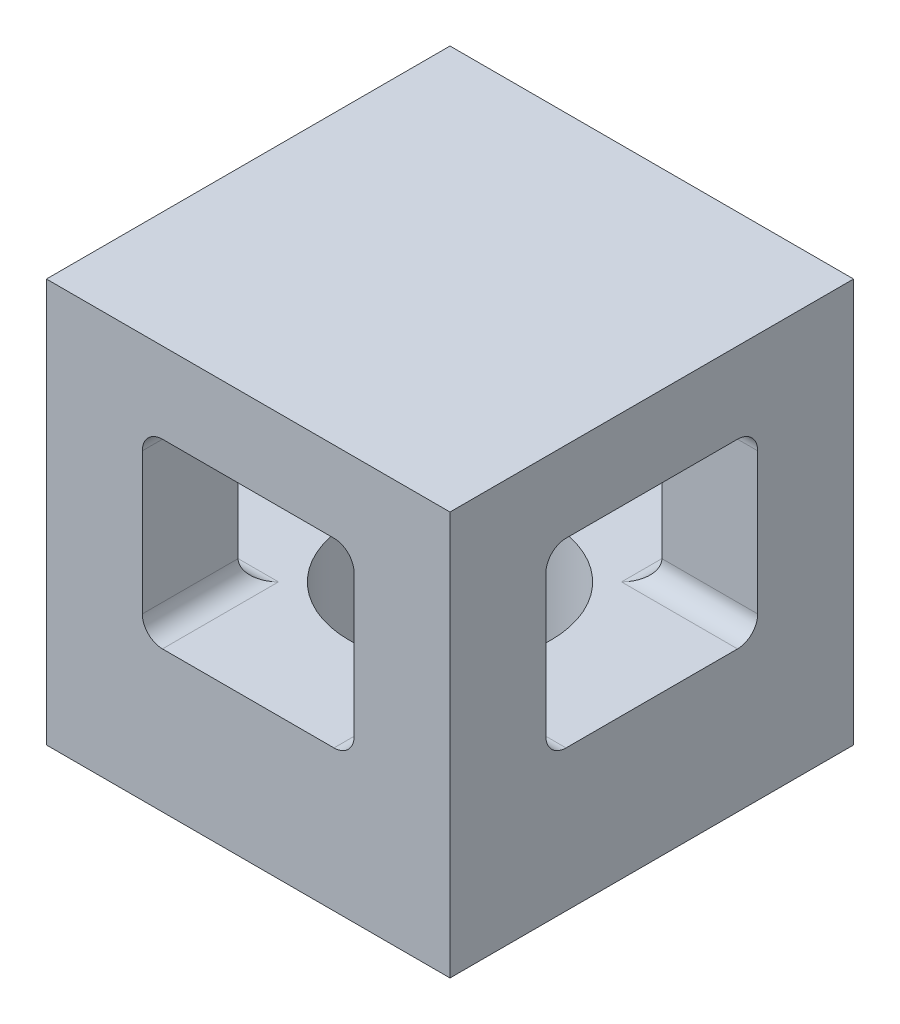
ISO-10303-21;
HEADER;
FILE_DESCRIPTION(('STEP AP214'),'2;1');
FILE_NAME('part.step','',(''),(''),'','','');
FILE_SCHEMA(('AUTOMOTIVE_DESIGN { 1 0 10303 214 1 1 1 1 }'));
ENDSEC;
DATA;
#1=APPLICATION_CONTEXT('core data for automotive mechanical design processes');
#2=APPLICATION_PROTOCOL_DEFINITION('international standard','automotive_design',2000,#1);
#3=PRODUCT_CONTEXT('',#1,'mechanical');
#4=PRODUCT('Part','Part','',(#3));
#5=PRODUCT_RELATED_PRODUCT_CATEGORY('part','',(#4));
#6=PRODUCT_DEFINITION_FORMATION('','',#4);
#7=PRODUCT_DEFINITION_CONTEXT('part definition',#1,'design');
#8=PRODUCT_DEFINITION('design','',#6,#7);
#9=PRODUCT_DEFINITION_SHAPE('','',#8);
#10=(LENGTH_UNIT() NAMED_UNIT(*) SI_UNIT(.MILLI.,.METRE.));
#11=(NAMED_UNIT(*) PLANE_ANGLE_UNIT() SI_UNIT($,.RADIAN.));
#12=(NAMED_UNIT(*) SI_UNIT($,.STERADIAN.) SOLID_ANGLE_UNIT());
#13=UNCERTAINTY_MEASURE_WITH_UNIT(LENGTH_MEASURE(1.E-05),#10,'distance_accuracy_value','');
#14=(GEOMETRIC_REPRESENTATION_CONTEXT(3) GLOBAL_UNCERTAINTY_ASSIGNED_CONTEXT((#13)) GLOBAL_UNIT_ASSIGNED_CONTEXT((#10,
#11,#12)) REPRESENTATION_CONTEXT('',''));
#15=CARTESIAN_POINT('',(0.,0.,0.));
#16=DIRECTION('',(0.,0.,1.));
#17=DIRECTION('',(1.,0.,0.));
#18=AXIS2_PLACEMENT_3D('',#15,#16,#17);
#19=CARTESIAN_POINT('',(0.,4.064,-2.921));
#20=DIRECTION('',(1.,0.,0.));
#21=DIRECTION('',(0.,0.,-1.));
#22=AXIS2_PLACEMENT_3D('',#19,#20,#21);
#23=CYLINDRICAL_SURFACE('',#22,0.508);
#24=DIRECTION('',(1.,0.,0.));
#25=VECTOR('',#24,1.);
#26=CARTESIAN_POINT('',(0.,4.064,-2.413));
#27=LINE('',#26,#25);
#28=CARTESIAN_POINT('',(0.,4.064,-2.413));
#29=VERTEX_POINT('',#28);
#30=CARTESIAN_POINT('',(2.413,4.06400000000001,-2.413));
#31=VERTEX_POINT('',#30);
#32=EDGE_CURVE('E385',#29,#31,#27,.T.);
#33=ORIENTED_EDGE('',*,*,#32,.T.);
#34=CARTESIAN_POINT('',(2.921,4.064,-2.921));
#35=DIRECTION('',(0.707106781186547,0.,0.707106781186547));
#36=DIRECTION('',(0.707106781186547,0.,-0.707106781186547));
#37=AXIS2_PLACEMENT_3D('',#34,#35,#36);
#38=ELLIPSE('',#37,0.718420489685532,0.508);
#39=CARTESIAN_POINT('',(2.921,3.556,-2.921));
#40=VERTEX_POINT('',#39);
#41=EDGE_CURVE('E333',#31,#40,#38,.T.);
#42=ORIENTED_EDGE('',*,*,#41,.T.);
#43=DIRECTION('',(1.,0.,0.));
#44=VECTOR('',#43,1.);
#45=CARTESIAN_POINT('',(0.,3.556,-2.921));
#46=LINE('',#45,#44);
#47=CARTESIAN_POINT('',(0.,3.556,-2.921));
#48=VERTEX_POINT('',#47);
#49=EDGE_CURVE('E413',#48,#40,#46,.T.);
#50=ORIENTED_EDGE('',*,*,#49,.F.);
#51=CARTESIAN_POINT('',(0.,4.064,-2.921));
#52=DIRECTION('',(1.,0.,0.));
#53=DIRECTION('',(0.,0.,-1.));
#54=AXIS2_PLACEMENT_3D('',#51,#52,#53);
#55=CIRCLE('',#54,0.508);
#56=EDGE_CURVE('E337',#29,#48,#55,.T.);
#57=ORIENTED_EDGE('',*,*,#56,.F.);
#58=EDGE_LOOP('',(#33,#42,#50,#57));
#59=FACE_BOUND('',#58,.T.);
#60=ADVANCED_FACE('F34',(#59),#23,.F.);
#61=CARTESIAN_POINT('',(0.,4.064,-7.239));
#62=DIRECTION('',(1.,0.,0.));
#63=DIRECTION('',(0.,0.,-1.));
#64=AXIS2_PLACEMENT_3D('',#61,#62,#63);
#65=CYLINDRICAL_SURFACE('',#64,0.508);
#66=DIRECTION('',(1.,0.,0.));
#67=VECTOR('',#66,1.);
#68=CARTESIAN_POINT('',(0.,3.556,-7.239));
#69=LINE('',#68,#67);
#70=CARTESIAN_POINT('',(0.,3.556,-7.239));
#71=VERTEX_POINT('',#70);
#72=CARTESIAN_POINT('',(2.921,3.556,-7.239));
#73=VERTEX_POINT('',#72);
#74=EDGE_CURVE('E410',#71,#73,#69,.T.);
#75=ORIENTED_EDGE('',*,*,#74,.T.);
#76=CARTESIAN_POINT('',(2.921,4.064,-7.239));
#77=DIRECTION('',(0.707106781186547,0.,-0.707106781186547));
#78=DIRECTION('',(0.707106781186547,0.,0.707106781186547));
#79=AXIS2_PLACEMENT_3D('',#76,#77,#78);
#80=ELLIPSE('',#79,0.718420489685532,0.508);
#81=CARTESIAN_POINT('',(2.413,4.06400000000001,-7.747));
#82=VERTEX_POINT('',#81);
#83=EDGE_CURVE('E227',#73,#82,#80,.T.);
#84=ORIENTED_EDGE('',*,*,#83,.T.);
#85=DIRECTION('',(1.,0.,0.));
#86=VECTOR('',#85,1.);
#87=CARTESIAN_POINT('',(0.,4.064,-7.747));
#88=LINE('',#87,#86);
#89=CARTESIAN_POINT('',(0.,4.064,-7.747));
#90=VERTEX_POINT('',#89);
#91=EDGE_CURVE('E406',#90,#82,#88,.T.);
#92=ORIENTED_EDGE('',*,*,#91,.F.);
#93=CARTESIAN_POINT('',(0.,4.064,-7.239));
#94=DIRECTION('',(1.,0.,0.));
#95=DIRECTION('',(0.,0.,-1.));
#96=AXIS2_PLACEMENT_3D('',#93,#94,#95);
#97=CIRCLE('',#96,0.508);
#98=EDGE_CURVE('E344',#71,#90,#97,.T.);
#99=ORIENTED_EDGE('',*,*,#98,.F.);
#100=EDGE_LOOP('',(#75,#84,#92,#99));
#101=FACE_BOUND('',#100,.T.);
#102=ADVANCED_FACE('F500',(#101),#65,.F.);
#103=CARTESIAN_POINT('',(0.,7.62,-2.921));
#104=DIRECTION('',(1.,0.,0.));
#105=DIRECTION('',(0.,0.,-1.));
#106=AXIS2_PLACEMENT_3D('',#103,#104,#105);
#107=CYLINDRICAL_SURFACE('',#106,0.508000000000001);
#108=DIRECTION('',(1.,0.,0.));
#109=VECTOR('',#108,1.);
#110=CARTESIAN_POINT('',(0.,8.128,-2.921));
#111=LINE('',#110,#109);
#112=CARTESIAN_POINT('',(0.,8.128,-2.921));
#113=VERTEX_POINT('',#112);
#114=CARTESIAN_POINT('',(2.921,8.128,-2.921));
#115=VERTEX_POINT('',#114);
#116=EDGE_CURVE('E394',#113,#115,#111,.T.);
#117=ORIENTED_EDGE('',*,*,#116,.T.);
#118=CARTESIAN_POINT('',(2.921,7.62,-2.921));
#119=DIRECTION('',(0.707106781186547,0.,0.707106781186547));
#120=DIRECTION('',(0.707106781186547,0.,-0.707106781186547));
#121=AXIS2_PLACEMENT_3D('',#118,#119,#120);
#122=ELLIPSE('',#121,0.718420489685533,0.508);
#123=CARTESIAN_POINT('',(2.413,7.61999999999999,-2.413));
#124=VERTEX_POINT('',#123);
#125=EDGE_CURVE('E317',#115,#124,#122,.T.);
#126=ORIENTED_EDGE('',*,*,#125,.T.);
#127=DIRECTION('',(1.,0.,0.));
#128=VECTOR('',#127,1.);
#129=CARTESIAN_POINT('',(0.,7.62,-2.413));
#130=LINE('',#129,#128);
#131=CARTESIAN_POINT('',(0.,7.62,-2.413));
#132=VERTEX_POINT('',#131);
#133=EDGE_CURVE('E390',#132,#124,#130,.T.);
#134=ORIENTED_EDGE('',*,*,#133,.F.);
#135=CARTESIAN_POINT('',(0.,7.62,-2.921));
#136=DIRECTION('',(1.,0.,0.));
#137=DIRECTION('',(0.,0.,-1.));
#138=AXIS2_PLACEMENT_3D('',#135,#136,#137);
#139=CIRCLE('',#138,0.508000000000001);
#140=EDGE_CURVE('E356',#113,#132,#139,.T.);
#141=ORIENTED_EDGE('',*,*,#140,.F.);
#142=EDGE_LOOP('',(#117,#126,#134,#141));
#143=FACE_BOUND('',#142,.T.);
#144=ADVANCED_FACE('F507',(#143),#107,.F.);
#145=CARTESIAN_POINT('',(0.,7.62,-7.239));
#146=DIRECTION('',(1.,0.,0.));
#147=DIRECTION('',(0.,0.,-1.));
#148=AXIS2_PLACEMENT_3D('',#145,#146,#147);
#149=CYLINDRICAL_SURFACE('',#148,0.508);
#150=DIRECTION('',(1.,0.,0.));
#151=VECTOR('',#150,1.);
#152=CARTESIAN_POINT('',(0.,7.62,-7.747));
#153=LINE('',#152,#151);
#154=CARTESIAN_POINT('',(0.,7.62,-7.747));
#155=VERTEX_POINT('',#154);
#156=CARTESIAN_POINT('',(2.413,7.61999999999999,-7.747));
#157=VERTEX_POINT('',#156);
#158=EDGE_CURVE('E402',#155,#157,#153,.T.);
#159=ORIENTED_EDGE('',*,*,#158,.T.);
#160=CARTESIAN_POINT('',(2.921,7.62,-7.239));
#161=DIRECTION('',(0.707106781186547,0.,-0.707106781186547));
#162=DIRECTION('',(0.707106781186547,0.,0.707106781186547));
#163=AXIS2_PLACEMENT_3D('',#160,#161,#162);
#164=ELLIPSE('',#163,0.718420489685532,0.508);
#165=CARTESIAN_POINT('',(2.921,8.128,-7.239));
#166=VERTEX_POINT('',#165);
#167=EDGE_CURVE('E314',#157,#166,#164,.T.);
#168=ORIENTED_EDGE('',*,*,#167,.T.);
#169=DIRECTION('',(1.,0.,0.));
#170=VECTOR('',#169,1.);
#171=CARTESIAN_POINT('',(0.,8.128,-7.239));
#172=LINE('',#171,#170);
#173=CARTESIAN_POINT('',(0.,8.128,-7.239));
#174=VERTEX_POINT('',#173);
#175=EDGE_CURVE('E398',#174,#166,#172,.T.);
#176=ORIENTED_EDGE('',*,*,#175,.F.);
#177=CARTESIAN_POINT('',(0.,7.62,-7.239));
#178=DIRECTION('',(1.,0.,0.));
#179=DIRECTION('',(0.,0.,1.));
#180=AXIS2_PLACEMENT_3D('',#177,#178,#179);
#181=CIRCLE('',#180,0.508);
#182=EDGE_CURVE('E350',#155,#174,#181,.T.);
#183=ORIENTED_EDGE('',*,*,#182,.F.);
#184=EDGE_LOOP('',(#159,#168,#176,#183));
#185=FACE_BOUND('',#184,.T.);
#186=ADVANCED_FACE('F557',(#185),#149,.F.);
#187=CARTESIAN_POINT('',(0.,7.62,-2.413));
#188=DIRECTION('',(0.,0.,1.));
#189=DIRECTION('',(1.,0.,0.));
#190=AXIS2_PLACEMENT_3D('',#187,#188,#189);
#191=PLANE('',#190);
#192=ORIENTED_EDGE('',*,*,#133,.T.);
#193=DIRECTION('',(0.,-1.,0.));
#194=VECTOR('',#193,1.);
#195=CARTESIAN_POINT('',(2.413,7.62,-2.413));
#196=LINE('',#195,#194);
#197=EDGE_CURVE('E329',#124,#31,#196,.T.);
#198=ORIENTED_EDGE('',*,*,#197,.T.);
#199=ORIENTED_EDGE('',*,*,#32,.F.);
#200=DIRECTION('',(0.,-1.,0.));
#201=VECTOR('',#200,1.);
#202=CARTESIAN_POINT('',(0.,7.62,-2.413));
#203=LINE('',#202,#201);
#204=EDGE_CURVE('E359',#132,#29,#203,.T.);
#205=ORIENTED_EDGE('',*,*,#204,.F.);
#206=EDGE_LOOP('',(#192,#198,#199,#205));
#207=FACE_BOUND('',#206,.T.);
#208=ADVANCED_FACE('F568',(#207),#191,.F.);
#209=CARTESIAN_POINT('',(0.,7.62,-7.747));
#210=DIRECTION('',(0.,0.,-1.));
#211=DIRECTION('',(-1.,0.,0.));
#212=AXIS2_PLACEMENT_3D('',#209,#210,#211);
#213=PLANE('',#212);
#214=ORIENTED_EDGE('',*,*,#91,.T.);
#215=DIRECTION('',(0.,1.,0.));
#216=VECTOR('',#215,1.);
#217=CARTESIAN_POINT('',(2.413,7.62,-7.747));
#218=LINE('',#217,#216);
#219=EDGE_CURVE('E11',#82,#157,#218,.T.);
#220=ORIENTED_EDGE('',*,*,#219,.T.);
#221=ORIENTED_EDGE('',*,*,#158,.F.);
#222=DIRECTION('',(0.,1.,0.));
#223=VECTOR('',#222,1.);
#224=CARTESIAN_POINT('',(0.,7.62,-7.747));
#225=LINE('',#224,#223);
#226=EDGE_CURVE('E347',#90,#155,#225,.T.);
#227=ORIENTED_EDGE('',*,*,#226,.F.);
#228=EDGE_LOOP('',(#214,#220,#221,#227));
#229=FACE_BOUND('',#228,.T.);
#230=ADVANCED_FACE('F560',(#229),#213,.F.);
#231=CARTESIAN_POINT('',(0.,10.16,0.));
#232=DIRECTION('',(1.,0.,0.));
#233=DIRECTION('',(0.,0.,-1.));
#234=AXIS2_PLACEMENT_3D('',#231,#232,#233);
#235=PLANE('',#234);
#236=ORIENTED_EDGE('',*,*,#204,.T.);
#237=ORIENTED_EDGE('',*,*,#56,.T.);
#238=DIRECTION('',(0.,0.,-1.));
#239=VECTOR('',#238,1.);
#240=CARTESIAN_POINT('',(0.,3.556,-2.921));
#241=LINE('',#240,#239);
#242=EDGE_CURVE('E340',#48,#71,#241,.T.);
#243=ORIENTED_EDGE('',*,*,#242,.T.);
#244=ORIENTED_EDGE('',*,*,#98,.T.);
#245=ORIENTED_EDGE('',*,*,#226,.T.);
#246=ORIENTED_EDGE('',*,*,#182,.T.);
#247=DIRECTION('',(0.,0.,1.));
#248=VECTOR('',#247,1.);
#249=CARTESIAN_POINT('',(0.,8.128,-2.921));
#250=LINE('',#249,#248);
#251=EDGE_CURVE('E353',#174,#113,#250,.T.);
#252=ORIENTED_EDGE('',*,*,#251,.T.);
#253=ORIENTED_EDGE('',*,*,#140,.T.);
#254=EDGE_LOOP('',(#236,#237,#243,#244,#245,#246,#252,#253));
#255=FACE_BOUND('',#254,.T.);
#256=DIRECTION('',(0.,0.,1.));
#257=VECTOR('',#256,1.);
#258=CARTESIAN_POINT('',(0.,0.,0.));
#259=LINE('',#258,#257);
#260=CARTESIAN_POINT('',(0.,0.,-10.16));
#261=VERTEX_POINT('',#260);
#262=CARTESIAN_POINT('',(0.,0.,0.));
#263=VERTEX_POINT('',#262);
#264=EDGE_CURVE('E418',#261,#263,#259,.T.);
#265=ORIENTED_EDGE('',*,*,#264,.T.);
#266=DIRECTION('',(0.,-1.,0.));
#267=VECTOR('',#266,1.);
#268=CARTESIAN_POINT('',(0.,10.16,0.));
#269=LINE('',#268,#267);
#270=CARTESIAN_POINT('',(0.,10.16,0.));
#271=VERTEX_POINT('',#270);
#272=EDGE_CURVE('E445',#271,#263,#269,.T.);
#273=ORIENTED_EDGE('',*,*,#272,.F.);
#274=DIRECTION('',(0.,0.,1.));
#275=VECTOR('',#274,1.);
#276=CARTESIAN_POINT('',(0.,10.16,0.));
#277=LINE('',#276,#275);
#278=CARTESIAN_POINT('',(0.,10.16,-10.16));
#279=VERTEX_POINT('',#278);
#280=EDGE_CURVE('E419',#279,#271,#277,.T.);
#281=ORIENTED_EDGE('',*,*,#280,.F.);
#282=DIRECTION('',(0.,-1.,0.));
#283=VECTOR('',#282,1.);
#284=CARTESIAN_POINT('',(0.,10.16,-10.16));
#285=LINE('',#284,#283);
#286=EDGE_CURVE('E429',#279,#261,#285,.T.);
#287=ORIENTED_EDGE('',*,*,#286,.T.);
#288=EDGE_LOOP('',(#265,#273,#281,#287));
#289=FACE_BOUND('',#288,.T.);
#290=ADVANCED_FACE('F36',(#255,#289),#235,.F.);
#291=CARTESIAN_POINT('',(0.,10.16,0.));
#292=DIRECTION('',(0.,0.,-1.));
#293=DIRECTION('',(-1.,0.,0.));
#294=AXIS2_PLACEMENT_3D('',#291,#292,#293);
#295=PLANE('',#294);
#296=DIRECTION('',(1.,0.,0.));
#297=VECTOR('',#296,1.);
#298=CARTESIAN_POINT('',(2.921,3.556,0.));
#299=LINE('',#298,#297);
#300=CARTESIAN_POINT('',(2.921,3.556,0.));
#301=VERTEX_POINT('',#300);
#302=CARTESIAN_POINT('',(7.239,3.556,0.));
#303=VERTEX_POINT('',#302);
#304=EDGE_CURVE('E268',#301,#303,#299,.T.);
#305=ORIENTED_EDGE('',*,*,#304,.F.);
#306=CARTESIAN_POINT('',(2.921,4.064,0.));
#307=DIRECTION('',(0.,0.,1.));
#308=DIRECTION('',(1.,0.,0.));
#309=AXIS2_PLACEMENT_3D('',#306,#307,#308);
#310=CIRCLE('',#309,0.508);
#311=CARTESIAN_POINT('',(2.413,4.06400000000001,0.));
#312=VERTEX_POINT('',#311);
#313=EDGE_CURVE('E49',#312,#301,#310,.T.);
#314=ORIENTED_EDGE('',*,*,#313,.F.);
#315=DIRECTION('',(0.,-1.,0.));
#316=VECTOR('',#315,1.);
#317=CARTESIAN_POINT('',(2.413,7.61999999999999,0.));
#318=LINE('',#317,#316);
#319=CARTESIAN_POINT('',(2.413,7.61999999999999,0.));
#320=VERTEX_POINT('',#319);
#321=EDGE_CURVE('E248',#320,#312,#318,.T.);
#322=ORIENTED_EDGE('',*,*,#321,.F.);
#323=CARTESIAN_POINT('',(2.921,7.62,0.));
#324=DIRECTION('',(0.,0.,1.));
#325=DIRECTION('',(1.,0.,0.));
#326=AXIS2_PLACEMENT_3D('',#323,#324,#325);
#327=CIRCLE('',#326,0.508);
#328=CARTESIAN_POINT('',(2.921,8.128,0.));
#329=VERTEX_POINT('',#328);
#330=EDGE_CURVE('E251',#329,#320,#327,.T.);
#331=ORIENTED_EDGE('',*,*,#330,.F.);
#332=DIRECTION('',(-1.,0.,0.));
#333=VECTOR('',#332,1.);
#334=CARTESIAN_POINT('',(2.921,8.128,0.));
#335=LINE('',#334,#333);
#336=CARTESIAN_POINT('',(7.239,8.128,0.));
#337=VERTEX_POINT('',#336);
#338=EDGE_CURVE('E280',#337,#329,#335,.T.);
#339=ORIENTED_EDGE('',*,*,#338,.F.);
#340=CARTESIAN_POINT('',(7.239,7.62,0.));
#341=DIRECTION('',(0.,0.,1.));
#342=DIRECTION('',(-1.,0.,0.));
#343=AXIS2_PLACEMENT_3D('',#340,#341,#342);
#344=CIRCLE('',#343,0.508);
#345=CARTESIAN_POINT('',(7.747,7.61999999999999,0.));
#346=VERTEX_POINT('',#345);
#347=EDGE_CURVE('E277',#346,#337,#344,.T.);
#348=ORIENTED_EDGE('',*,*,#347,.F.);
#349=DIRECTION('',(0.,1.,0.));
#350=VECTOR('',#349,1.);
#351=CARTESIAN_POINT('',(7.747,7.61999999999999,0.));
#352=LINE('',#351,#350);
#353=CARTESIAN_POINT('',(7.747,4.06400000000001,0.));
#354=VERTEX_POINT('',#353);
#355=EDGE_CURVE('E274',#354,#346,#352,.T.);
#356=ORIENTED_EDGE('',*,*,#355,.F.);
#357=CARTESIAN_POINT('',(7.239,4.064,0.));
#358=DIRECTION('',(0.,0.,1.));
#359=DIRECTION('',(1.,0.,0.));
#360=AXIS2_PLACEMENT_3D('',#357,#358,#359);
#361=CIRCLE('',#360,0.508);
#362=EDGE_CURVE('E271',#303,#354,#361,.T.);
#363=ORIENTED_EDGE('',*,*,#362,.F.);
#364=EDGE_LOOP('',(#305,#314,#322,#331,#339,#348,#356,#363));
#365=FACE_BOUND('',#364,.T.);
#366=DIRECTION('',(1.,0.,0.));
#367=VECTOR('',#366,1.);
#368=CARTESIAN_POINT('',(0.,0.,0.));
#369=LINE('',#368,#367);
#370=CARTESIAN_POINT('',(10.16,0.,0.));
#371=VERTEX_POINT('',#370);
#372=EDGE_CURVE('E432',#263,#371,#369,.T.);
#373=ORIENTED_EDGE('',*,*,#372,.T.);
#374=DIRECTION('',(0.,-1.,0.));
#375=VECTOR('',#374,1.);
#376=CARTESIAN_POINT('',(10.16,10.16,0.));
#377=LINE('',#376,#375);
#378=CARTESIAN_POINT('',(10.16,10.16,0.));
#379=VERTEX_POINT('',#378);
#380=EDGE_CURVE('E442',#379,#371,#377,.T.);
#381=ORIENTED_EDGE('',*,*,#380,.F.);
#382=DIRECTION('',(1.,0.,0.));
#383=VECTOR('',#382,1.);
#384=CARTESIAN_POINT('',(0.,10.16,0.));
#385=LINE('',#384,#383);
#386=EDGE_CURVE('E422',#271,#379,#385,.T.);
#387=ORIENTED_EDGE('',*,*,#386,.F.);
#388=ORIENTED_EDGE('',*,*,#272,.T.);
#389=EDGE_LOOP('',(#373,#381,#387,#388));
#390=FACE_BOUND('',#389,.T.);
#391=ADVANCED_FACE('F544',(#365,#390),#295,.F.);
#392=CARTESIAN_POINT('',(10.16,10.16,0.));
#393=DIRECTION('',(-1.,0.,0.));
#394=DIRECTION('',(0.,0.,1.));
#395=AXIS2_PLACEMENT_3D('',#392,#393,#394);
#396=PLANE('',#395);
#397=DIRECTION('',(0.,0.,-1.));
#398=VECTOR('',#397,1.);
#399=CARTESIAN_POINT('',(10.16,3.556,-2.921));
#400=LINE('',#399,#398);
#401=CARTESIAN_POINT('',(10.16,3.556,-2.921));
#402=VERTEX_POINT('',#401);
#403=CARTESIAN_POINT('',(10.16,3.556,-7.239));
#404=VERTEX_POINT('',#403);
#405=EDGE_CURVE('E365',#402,#404,#400,.T.);
#406=ORIENTED_EDGE('',*,*,#405,.F.);
#407=CARTESIAN_POINT('',(10.16,4.064,-2.921));
#408=DIRECTION('',(1.,0.,0.));
#409=DIRECTION('',(0.,0.,-1.));
#410=AXIS2_PLACEMENT_3D('',#407,#408,#409);
#411=CIRCLE('',#410,0.508);
#412=CARTESIAN_POINT('',(10.16,4.064,-2.413));
#413=VERTEX_POINT('',#412);
#414=EDGE_CURVE('E336',#413,#402,#411,.T.);
#415=ORIENTED_EDGE('',*,*,#414,.F.);
#416=DIRECTION('',(0.,-1.,0.));
#417=VECTOR('',#416,1.);
#418=CARTESIAN_POINT('',(10.16,7.62,-2.413));
#419=LINE('',#418,#417);
#420=CARTESIAN_POINT('',(10.16,7.62,-2.413));
#421=VERTEX_POINT('',#420);
#422=EDGE_CURVE('E341',#421,#413,#419,.T.);
#423=ORIENTED_EDGE('',*,*,#422,.F.);
#424=CARTESIAN_POINT('',(10.16,7.62,-2.921));
#425=DIRECTION('',(1.,0.,0.));
#426=DIRECTION('',(0.,0.,-1.));
#427=AXIS2_PLACEMENT_3D('',#424,#425,#426);
#428=CIRCLE('',#427,0.508000000000001);
#429=CARTESIAN_POINT('',(10.16,8.128,-2.921));
#430=VERTEX_POINT('',#429);
#431=EDGE_CURVE('E380',#430,#421,#428,.T.);
#432=ORIENTED_EDGE('',*,*,#431,.F.);
#433=DIRECTION('',(0.,0.,1.));
#434=VECTOR('',#433,1.);
#435=CARTESIAN_POINT('',(10.16,8.128,-2.921));
#436=LINE('',#435,#434);
#437=CARTESIAN_POINT('',(10.16,8.128,-7.239));
#438=VERTEX_POINT('',#437);
#439=EDGE_CURVE('E377',#438,#430,#436,.T.);
#440=ORIENTED_EDGE('',*,*,#439,.F.);
#441=CARTESIAN_POINT('',(10.16,7.62,-7.239));
#442=DIRECTION('',(1.,0.,0.));
#443=DIRECTION('',(0.,0.,1.));
#444=AXIS2_PLACEMENT_3D('',#441,#442,#443);
#445=CIRCLE('',#444,0.508);
#446=CARTESIAN_POINT('',(10.16,7.62,-7.747));
#447=VERTEX_POINT('',#446);
#448=EDGE_CURVE('E374',#447,#438,#445,.T.);
#449=ORIENTED_EDGE('',*,*,#448,.F.);
#450=DIRECTION('',(0.,1.,0.));
#451=VECTOR('',#450,1.);
#452=CARTESIAN_POINT('',(10.16,7.62,-7.747));
#453=LINE('',#452,#451);
#454=CARTESIAN_POINT('',(10.16,4.064,-7.747));
#455=VERTEX_POINT('',#454);
#456=EDGE_CURVE('E371',#455,#447,#453,.T.);
#457=ORIENTED_EDGE('',*,*,#456,.F.);
#458=CARTESIAN_POINT('',(10.16,4.064,-7.239));
#459=DIRECTION('',(1.,0.,0.));
#460=DIRECTION('',(0.,0.,-1.));
#461=AXIS2_PLACEMENT_3D('',#458,#459,#460);
#462=CIRCLE('',#461,0.508);
#463=EDGE_CURVE('E368',#404,#455,#462,.T.);
#464=ORIENTED_EDGE('',*,*,#463,.F.);
#465=EDGE_LOOP('',(#406,#415,#423,#432,#440,#449,#457,#464));
#466=FACE_BOUND('',#465,.T.);
#467=DIRECTION('',(0.,0.,-1.));
#468=VECTOR('',#467,1.);
#469=CARTESIAN_POINT('',(10.16,0.,0.));
#470=LINE('',#469,#468);
#471=CARTESIAN_POINT('',(10.16,0.,-10.16));
#472=VERTEX_POINT('',#471);
#473=EDGE_CURVE('E434',#371,#472,#470,.T.);
#474=ORIENTED_EDGE('',*,*,#473,.T.);
#475=DIRECTION('',(0.,-1.,0.));
#476=VECTOR('',#475,1.);
#477=CARTESIAN_POINT('',(10.16,10.16,-10.16));
#478=LINE('',#477,#476);
#479=CARTESIAN_POINT('',(10.16,10.16,-10.16));
#480=VERTEX_POINT('',#479);
#481=EDGE_CURVE('E439',#480,#472,#478,.T.);
#482=ORIENTED_EDGE('',*,*,#481,.F.);
#483=DIRECTION('',(0.,0.,-1.));
#484=VECTOR('',#483,1.);
#485=CARTESIAN_POINT('',(10.16,10.16,0.));
#486=LINE('',#485,#484);
#487=EDGE_CURVE('E425',#379,#480,#486,.T.);
#488=ORIENTED_EDGE('',*,*,#487,.F.);
#489=ORIENTED_EDGE('',*,*,#380,.T.);
#490=EDGE_LOOP('',(#474,#482,#488,#489));
#491=FACE_BOUND('',#490,.T.);
#492=ADVANCED_FACE('F463',(#466,#491),#396,.F.);
#493=CARTESIAN_POINT('',(0.,10.16,-10.16));
#494=DIRECTION('',(0.,0.,1.));
#495=DIRECTION('',(1.,0.,0.));
#496=AXIS2_PLACEMENT_3D('',#493,#494,#495);
#497=PLANE('',#496);
#498=DIRECTION('',(0.,-1.,0.));
#499=VECTOR('',#498,1.);
#500=CARTESIAN_POINT('',(2.413,7.61999999999999,-10.16));
#501=LINE('',#500,#499);
#502=CARTESIAN_POINT('',(2.413,7.61999999999999,-10.16));
#503=VERTEX_POINT('',#502);
#504=CARTESIAN_POINT('',(2.413,4.06400000000001,-10.16));
#505=VERTEX_POINT('',#504);
#506=EDGE_CURVE('E247',#503,#505,#501,.T.);
#507=ORIENTED_EDGE('',*,*,#506,.T.);
#508=CARTESIAN_POINT('',(2.921,4.064,-10.16));
#509=DIRECTION('',(0.,0.,1.));
#510=DIRECTION('',(1.,0.,0.));
#511=AXIS2_PLACEMENT_3D('',#508,#509,#510);
#512=CIRCLE('',#511,0.508);
#513=CARTESIAN_POINT('',(2.921,3.556,-10.16));
#514=VERTEX_POINT('',#513);
#515=EDGE_CURVE('E224',#505,#514,#512,.T.);
#516=ORIENTED_EDGE('',*,*,#515,.T.);
#517=DIRECTION('',(1.,0.,0.));
#518=VECTOR('',#517,1.);
#519=CARTESIAN_POINT('',(2.921,3.556,-10.16));
#520=LINE('',#519,#518);
#521=CARTESIAN_POINT('',(7.239,3.556,-10.16));
#522=VERTEX_POINT('',#521);
#523=EDGE_CURVE('E235',#514,#522,#520,.T.);
#524=ORIENTED_EDGE('',*,*,#523,.T.);
#525=CARTESIAN_POINT('',(7.239,4.064,-10.16));
#526=DIRECTION('',(0.,0.,1.));
#527=DIRECTION('',(1.,0.,0.));
#528=AXIS2_PLACEMENT_3D('',#525,#526,#527);
#529=CIRCLE('',#528,0.508);
#530=CARTESIAN_POINT('',(7.747,4.06400000000001,-10.16));
#531=VERTEX_POINT('',#530);
#532=EDGE_CURVE('E57',#522,#531,#529,.T.);
#533=ORIENTED_EDGE('',*,*,#532,.T.);
#534=DIRECTION('',(0.,1.,0.));
#535=VECTOR('',#534,1.);
#536=CARTESIAN_POINT('',(7.747,7.61999999999999,-10.16));
#537=LINE('',#536,#535);
#538=CARTESIAN_POINT('',(7.747,7.61999999999999,-10.16));
#539=VERTEX_POINT('',#538);
#540=EDGE_CURVE('E255',#531,#539,#537,.T.);
#541=ORIENTED_EDGE('',*,*,#540,.T.);
#542=CARTESIAN_POINT('',(7.239,7.62,-10.16));
#543=DIRECTION('',(0.,0.,1.));
#544=DIRECTION('',(-1.,0.,0.));
#545=AXIS2_PLACEMENT_3D('',#542,#543,#544);
#546=CIRCLE('',#545,0.508);
#547=CARTESIAN_POINT('',(7.239,8.128,-10.16));
#548=VERTEX_POINT('',#547);
#549=EDGE_CURVE('E258',#539,#548,#546,.T.);
#550=ORIENTED_EDGE('',*,*,#549,.T.);
#551=DIRECTION('',(-1.,0.,0.));
#552=VECTOR('',#551,1.);
#553=CARTESIAN_POINT('',(2.921,8.128,-10.16));
#554=LINE('',#553,#552);
#555=CARTESIAN_POINT('',(2.921,8.128,-10.16));
#556=VERTEX_POINT('',#555);
#557=EDGE_CURVE('E261',#548,#556,#554,.T.);
#558=ORIENTED_EDGE('',*,*,#557,.T.);
#559=CARTESIAN_POINT('',(2.921,7.62,-10.16));
#560=DIRECTION('',(0.,0.,1.));
#561=DIRECTION('',(1.,0.,0.));
#562=AXIS2_PLACEMENT_3D('',#559,#560,#561);
#563=CIRCLE('',#562,0.508);
#564=EDGE_CURVE('E264',#556,#503,#563,.T.);
#565=ORIENTED_EDGE('',*,*,#564,.T.);
#566=EDGE_LOOP('',(#507,#516,#524,#533,#541,#550,#558,#565));
#567=FACE_BOUND('',#566,.T.);
#568=DIRECTION('',(-1.,0.,0.));
#569=VECTOR('',#568,1.);
#570=CARTESIAN_POINT('',(0.,0.,-10.16));
#571=LINE('',#570,#569);
#572=EDGE_CURVE('E423',#472,#261,#571,.T.);
#573=ORIENTED_EDGE('',*,*,#572,.T.);
#574=ORIENTED_EDGE('',*,*,#286,.F.);
#575=DIRECTION('',(-1.,0.,0.));
#576=VECTOR('',#575,1.);
#577=CARTESIAN_POINT('',(0.,10.16,-10.16));
#578=LINE('',#577,#576);
#579=EDGE_CURVE('E427',#480,#279,#578,.T.);
#580=ORIENTED_EDGE('',*,*,#579,.F.);
#581=ORIENTED_EDGE('',*,*,#481,.T.);
#582=EDGE_LOOP('',(#573,#574,#580,#581));
#583=FACE_BOUND('',#582,.T.);
#584=ADVANCED_FACE('F243',(#567,#583),#497,.F.);
#585=CARTESIAN_POINT('',(0.,10.16,0.));
#586=DIRECTION('',(0.,-1.,0.));
#587=DIRECTION('',(0.,0.,-1.));
#588=AXIS2_PLACEMENT_3D('',#585,#586,#587);
#589=PLANE('',#588);
#590=ORIENTED_EDGE('',*,*,#280,.T.);
#591=ORIENTED_EDGE('',*,*,#386,.T.);
#592=ORIENTED_EDGE('',*,*,#487,.T.);
#593=ORIENTED_EDGE('',*,*,#579,.T.);
#594=EDGE_LOOP('',(#590,#591,#592,#593));
#595=FACE_BOUND('',#594,.T.);
#596=ADVANCED_FACE('F760',(#595),#589,.F.);
#597=CARTESIAN_POINT('',(0.,0.,0.));
#598=DIRECTION('',(0.,-1.,0.));
#599=DIRECTION('',(0.,0.,-1.));
#600=AXIS2_PLACEMENT_3D('',#597,#598,#599);
#601=PLANE('',#600);
#602=CARTESIAN_POINT('',(5.08,0.,-5.08));
#603=DIRECTION('',(0.,-1.,0.));
#604=DIRECTION('',(0.,0.,-1.));
#605=AXIS2_PLACEMENT_3D('',#602,#603,#604);
#606=CIRCLE('',#605,2.54);
#607=CARTESIAN_POINT('',(5.08,0.,-7.62));
#608=VERTEX_POINT('',#607);
#609=EDGE_CURVE('E388',#608,#608,#606,.T.);
#610=ORIENTED_EDGE('',*,*,#609,.F.);
#611=EDGE_LOOP('',(#610));
#612=FACE_BOUND('',#611,.T.);
#613=ORIENTED_EDGE('',*,*,#264,.F.);
#614=ORIENTED_EDGE('',*,*,#572,.F.);
#615=ORIENTED_EDGE('',*,*,#473,.F.);
#616=ORIENTED_EDGE('',*,*,#372,.F.);
#617=EDGE_LOOP('',(#613,#614,#615,#616));
#618=FACE_BOUND('',#617,.T.);
#619=ADVANCED_FACE('F519',(#612,#618),#601,.T.);
#620=CARTESIAN_POINT('',(5.08,8.128,-5.08));
#621=DIRECTION('',(0.,-1.,0.));
#622=DIRECTION('',(0.,0.,-1.));
#623=AXIS2_PLACEMENT_3D('',#620,#621,#622);
#624=CYLINDRICAL_SURFACE('',#623,2.54);
#625=CARTESIAN_POINT('',(5.08,3.556,-5.08));
#626=DIRECTION('',(0.,-1.,0.));
#627=DIRECTION('',(0.,0.,-1.));
#628=AXIS2_PLACEMENT_3D('',#625,#626,#627);
#629=CIRCLE('',#628,2.54);
#630=CARTESIAN_POINT('',(5.08,3.556,-7.62));
#631=VERTEX_POINT('',#630);
#632=EDGE_CURVE('E448',#631,#631,#629,.F.);
#633=ORIENTED_EDGE('',*,*,#632,.T.);
#634=EDGE_LOOP('',(#633));
#635=FACE_BOUND('',#634,.T.);
#636=ORIENTED_EDGE('',*,*,#609,.T.);
#637=EDGE_LOOP('',(#636));
#638=FACE_BOUND('',#637,.T.);
#639=ADVANCED_FACE('F513',(#635,#638),#624,.F.);
#640=CARTESIAN_POINT('',(7.239,3.556,-2.921));
#641=VERTEX_POINT('',#640);
#642=EDGE_CURVE('E362',#641,#402,#46,.T.);
#643=ORIENTED_EDGE('',*,*,#642,.F.);
#644=CARTESIAN_POINT('',(7.239,4.064,-2.921));
#645=DIRECTION('',(0.707106781186547,0.,-0.707106781186547));
#646=DIRECTION('',(0.707106781186547,0.,0.707106781186547));
#647=AXIS2_PLACEMENT_3D('',#644,#645,#646);
#648=ELLIPSE('',#647,0.718420489685532,0.508);
#649=CARTESIAN_POINT('',(7.747,4.06400000000001,-2.413));
#650=VERTEX_POINT('',#649);
#651=EDGE_CURVE('E323',#641,#650,#648,.F.);
#652=ORIENTED_EDGE('',*,*,#651,.T.);
#653=EDGE_CURVE('E389',#650,#413,#27,.T.);
#654=ORIENTED_EDGE('',*,*,#653,.T.);
#655=ORIENTED_EDGE('',*,*,#414,.T.);
#656=EDGE_LOOP('',(#643,#652,#654,#655));
#657=FACE_BOUND('',#656,.T.);
#658=ADVANCED_FACE('F503',(#657),#23,.F.);
#659=CARTESIAN_POINT('',(7.747,4.06400000000001,-7.747));
#660=VERTEX_POINT('',#659);
#661=EDGE_CURVE('E409',#660,#455,#88,.T.);
#662=ORIENTED_EDGE('',*,*,#661,.F.);
#663=CARTESIAN_POINT('',(7.239,4.064,-7.239));
#664=DIRECTION('',(0.707106781186547,0.,0.707106781186547));
#665=DIRECTION('',(0.707106781186547,0.,-0.707106781186547));
#666=AXIS2_PLACEMENT_3D('',#663,#664,#665);
#667=ELLIPSE('',#666,0.718420489685532,0.508);
#668=CARTESIAN_POINT('',(7.239,3.556,-7.239));
#669=VERTEX_POINT('',#668);
#670=EDGE_CURVE('E320',#660,#669,#667,.F.);
#671=ORIENTED_EDGE('',*,*,#670,.T.);
#672=EDGE_CURVE('E412',#669,#404,#69,.T.);
#673=ORIENTED_EDGE('',*,*,#672,.T.);
#674=ORIENTED_EDGE('',*,*,#463,.T.);
#675=EDGE_LOOP('',(#662,#671,#673,#674));
#676=FACE_BOUND('',#675,.T.);
#677=ADVANCED_FACE('F457',(#676),#65,.F.);
#678=CARTESIAN_POINT('',(0.,3.556,-2.921));
#679=DIRECTION('',(0.,-1.,0.));
#680=DIRECTION('',(0.,0.,-1.));
#681=AXIS2_PLACEMENT_3D('',#678,#679,#680);
#682=PLANE('',#681);
#683=DIRECTION('',(0.,0.,1.));
#684=VECTOR('',#683,1.);
#685=CARTESIAN_POINT('',(7.239,3.556,-10.16));
#686=LINE('',#685,#684);
#687=EDGE_CURVE('E231',#641,#303,#686,.T.);
#688=ORIENTED_EDGE('',*,*,#687,.F.);
#689=ORIENTED_EDGE('',*,*,#642,.T.);
#690=ORIENTED_EDGE('',*,*,#405,.T.);
#691=ORIENTED_EDGE('',*,*,#672,.F.);
#692=EDGE_CURVE('E240',#522,#669,#686,.T.);
#693=ORIENTED_EDGE('',*,*,#692,.F.);
#694=ORIENTED_EDGE('',*,*,#523,.F.);
#695=DIRECTION('',(0.,0.,1.));
#696=VECTOR('',#695,1.);
#697=CARTESIAN_POINT('',(2.921,3.556,-10.16));
#698=LINE('',#697,#696);
#699=EDGE_CURVE('E219',#514,#73,#698,.T.);
#700=ORIENTED_EDGE('',*,*,#699,.T.);
#701=ORIENTED_EDGE('',*,*,#74,.F.);
#702=ORIENTED_EDGE('',*,*,#242,.F.);
#703=ORIENTED_EDGE('',*,*,#49,.T.);
#704=EDGE_CURVE('E232',#40,#301,#698,.T.);
#705=ORIENTED_EDGE('',*,*,#704,.T.);
#706=ORIENTED_EDGE('',*,*,#304,.T.);
#707=EDGE_LOOP('',(#688,#689,#690,#691,#693,#694,#700,#701,#702,#703,#705,#706));
#708=FACE_BOUND('',#707,.T.);
#709=ORIENTED_EDGE('',*,*,#632,.F.);
#710=EDGE_LOOP('',(#709));
#711=FACE_BOUND('',#710,.T.);
#712=ADVANCED_FACE('F237',(#708,#711),#682,.F.);
#713=CARTESIAN_POINT('',(7.747,7.61999999999999,-2.413));
#714=VERTEX_POINT('',#713);
#715=EDGE_CURVE('E393',#714,#421,#130,.T.);
#716=ORIENTED_EDGE('',*,*,#715,.F.);
#717=CARTESIAN_POINT('',(7.239,7.62,-2.921));
#718=DIRECTION('',(0.707106781186547,0.,-0.707106781186547));
#719=DIRECTION('',(0.707106781186547,0.,0.707106781186547));
#720=AXIS2_PLACEMENT_3D('',#717,#718,#719);
#721=ELLIPSE('',#720,0.718420489685533,0.508);
#722=CARTESIAN_POINT('',(7.239,8.128,-2.921));
#723=VERTEX_POINT('',#722);
#724=EDGE_CURVE('E311',#714,#723,#721,.F.);
#725=ORIENTED_EDGE('',*,*,#724,.T.);
#726=EDGE_CURVE('E397',#723,#430,#111,.T.);
#727=ORIENTED_EDGE('',*,*,#726,.T.);
#728=ORIENTED_EDGE('',*,*,#431,.T.);
#729=EDGE_LOOP('',(#716,#725,#727,#728));
#730=FACE_BOUND('',#729,.T.);
#731=ADVANCED_FACE('F536',(#730),#107,.F.);
#732=CARTESIAN_POINT('',(7.239,8.128,-7.239));
#733=VERTEX_POINT('',#732);
#734=EDGE_CURVE('E401',#733,#438,#172,.T.);
#735=ORIENTED_EDGE('',*,*,#734,.F.);
#736=CARTESIAN_POINT('',(7.239,7.62,-7.239));
#737=DIRECTION('',(0.707106781186547,0.,0.707106781186547));
#738=DIRECTION('',(0.707106781186547,0.,-0.707106781186547));
#739=AXIS2_PLACEMENT_3D('',#736,#737,#738);
#740=ELLIPSE('',#739,0.718420489685532,0.508);
#741=CARTESIAN_POINT('',(7.747,7.61999999999999,-7.747));
#742=VERTEX_POINT('',#741);
#743=EDGE_CURVE('E287',#733,#742,#740,.F.);
#744=ORIENTED_EDGE('',*,*,#743,.T.);
#745=EDGE_CURVE('E405',#742,#447,#153,.T.);
#746=ORIENTED_EDGE('',*,*,#745,.T.);
#747=ORIENTED_EDGE('',*,*,#448,.T.);
#748=EDGE_LOOP('',(#735,#744,#746,#747));
#749=FACE_BOUND('',#748,.T.);
#750=ADVANCED_FACE('F469',(#749),#149,.F.);
#751=ORIENTED_EDGE('',*,*,#653,.F.);
#752=DIRECTION('',(0.,1.,0.));
#753=VECTOR('',#752,1.);
#754=CARTESIAN_POINT('',(7.747,7.62,-2.413));
#755=LINE('',#754,#753);
#756=EDGE_CURVE('E326',#650,#714,#755,.T.);
#757=ORIENTED_EDGE('',*,*,#756,.T.);
#758=ORIENTED_EDGE('',*,*,#715,.T.);
#759=ORIENTED_EDGE('',*,*,#422,.T.);
#760=EDGE_LOOP('',(#751,#757,#758,#759));
#761=FACE_BOUND('',#760,.T.);
#762=ADVANCED_FACE('F534',(#761),#191,.F.);
#763=ORIENTED_EDGE('',*,*,#745,.F.);
#764=DIRECTION('',(0.,-1.,0.));
#765=VECTOR('',#764,1.);
#766=CARTESIAN_POINT('',(7.747,7.62,-7.747));
#767=LINE('',#766,#765);
#768=EDGE_CURVE('E42',#742,#660,#767,.T.);
#769=ORIENTED_EDGE('',*,*,#768,.T.);
#770=ORIENTED_EDGE('',*,*,#661,.T.);
#771=ORIENTED_EDGE('',*,*,#456,.T.);
#772=EDGE_LOOP('',(#763,#769,#770,#771));
#773=FACE_BOUND('',#772,.T.);
#774=ADVANCED_FACE('F454',(#773),#213,.F.);
#775=CARTESIAN_POINT('',(5.08,8.128,-5.08));
#776=DIRECTION('',(0.,-1.,0.));
#777=DIRECTION('',(0.,0.,-1.));
#778=AXIS2_PLACEMENT_3D('',#775,#776,#777);
#779=PLANE('',#778);
#780=ORIENTED_EDGE('',*,*,#726,.F.);
#781=DIRECTION('',(0.,0.,1.));
#782=VECTOR('',#781,1.);
#783=CARTESIAN_POINT('',(7.239,8.128,-10.16));
#784=LINE('',#783,#782);
#785=EDGE_CURVE('E299',#723,#337,#784,.T.);
#786=ORIENTED_EDGE('',*,*,#785,.T.);
#787=ORIENTED_EDGE('',*,*,#338,.T.);
#788=DIRECTION('',(0.,0.,1.));
#789=VECTOR('',#788,1.);
#790=CARTESIAN_POINT('',(2.921,8.128,-10.16));
#791=LINE('',#790,#789);
#792=EDGE_CURVE('E295',#115,#329,#791,.T.);
#793=ORIENTED_EDGE('',*,*,#792,.F.);
#794=ORIENTED_EDGE('',*,*,#116,.F.);
#795=ORIENTED_EDGE('',*,*,#251,.F.);
#796=ORIENTED_EDGE('',*,*,#175,.T.);
#797=EDGE_CURVE('E293',#556,#166,#791,.T.);
#798=ORIENTED_EDGE('',*,*,#797,.F.);
#799=ORIENTED_EDGE('',*,*,#557,.F.);
#800=EDGE_CURVE('E296',#548,#733,#784,.T.);
#801=ORIENTED_EDGE('',*,*,#800,.T.);
#802=ORIENTED_EDGE('',*,*,#734,.T.);
#803=ORIENTED_EDGE('',*,*,#439,.T.);
#804=EDGE_LOOP('',(#780,#786,#787,#793,#794,#795,#796,#798,#799,#801,#802,#803));
#805=FACE_BOUND('',#804,.T.);
#806=ADVANCED_FACE('F476',(#805),#779,.T.);
#807=CARTESIAN_POINT('',(7.747,7.61999999999999,-10.16));
#808=DIRECTION('',(1.,0.,0.));
#809=DIRECTION('',(0.,1.,0.));
#810=AXIS2_PLACEMENT_3D('',#807,#808,#809);
#811=PLANE('',#810);
#812=DIRECTION('',(0.,0.,1.));
#813=VECTOR('',#812,1.);
#814=CARTESIAN_POINT('',(7.747,7.61999999999999,-10.16));
#815=LINE('',#814,#813);
#816=EDGE_CURVE('E300',#539,#742,#815,.T.);
#817=ORIENTED_EDGE('',*,*,#816,.F.);
#818=ORIENTED_EDGE('',*,*,#540,.F.);
#819=DIRECTION('',(0.,0.,1.));
#820=VECTOR('',#819,1.);
#821=CARTESIAN_POINT('',(7.747,4.06400000000001,-10.16));
#822=LINE('',#821,#820);
#823=EDGE_CURVE('E304',#531,#660,#822,.T.);
#824=ORIENTED_EDGE('',*,*,#823,.T.);
#825=ORIENTED_EDGE('',*,*,#768,.F.);
#826=EDGE_LOOP('',(#817,#818,#824,#825));
#827=FACE_BOUND('',#826,.T.);
#828=ADVANCED_FACE('F479',(#827),#811,.F.);
#829=CARTESIAN_POINT('',(7.239,7.62,-10.16));
#830=DIRECTION('',(0.,0.,1.));
#831=DIRECTION('',(1.,0.,0.));
#832=AXIS2_PLACEMENT_3D('',#829,#830,#831);
#833=CYLINDRICAL_SURFACE('',#832,0.508);
#834=ORIENTED_EDGE('',*,*,#800,.F.);
#835=ORIENTED_EDGE('',*,*,#549,.F.);
#836=ORIENTED_EDGE('',*,*,#816,.T.);
#837=ORIENTED_EDGE('',*,*,#743,.F.);
#838=EDGE_LOOP('',(#834,#835,#836,#837));
#839=FACE_BOUND('',#838,.T.);
#840=ADVANCED_FACE('F471',(#839),#833,.F.);
#841=CARTESIAN_POINT('',(2.413,7.61999999999999,-10.16));
#842=DIRECTION('',(-1.,0.,0.));
#843=DIRECTION('',(0.,0.,1.));
#844=AXIS2_PLACEMENT_3D('',#841,#842,#843);
#845=PLANE('',#844);
#846=DIRECTION('',(0.,0.,1.));
#847=VECTOR('',#846,1.);
#848=CARTESIAN_POINT('',(2.413,4.06400000000001,-10.16));
#849=LINE('',#848,#847);
#850=EDGE_CURVE('E285',#505,#82,#849,.T.);
#851=ORIENTED_EDGE('',*,*,#850,.F.);
#852=ORIENTED_EDGE('',*,*,#506,.F.);
#853=DIRECTION('',(0.,0.,1.));
#854=VECTOR('',#853,1.);
#855=CARTESIAN_POINT('',(2.413,7.61999999999999,-10.16));
#856=LINE('',#855,#854);
#857=EDGE_CURVE('E289',#503,#157,#856,.T.);
#858=ORIENTED_EDGE('',*,*,#857,.T.);
#859=ORIENTED_EDGE('',*,*,#219,.F.);
#860=EDGE_LOOP('',(#851,#852,#858,#859));
#861=FACE_BOUND('',#860,.T.);
#862=ADVANCED_FACE('F491',(#861),#845,.F.);
#863=CARTESIAN_POINT('',(2.921,7.62,-10.16));
#864=DIRECTION('',(0.,0.,1.));
#865=DIRECTION('',(1.,0.,0.));
#866=AXIS2_PLACEMENT_3D('',#863,#864,#865);
#867=CYLINDRICAL_SURFACE('',#866,0.508);
#868=ORIENTED_EDGE('',*,*,#857,.F.);
#869=ORIENTED_EDGE('',*,*,#564,.F.);
#870=ORIENTED_EDGE('',*,*,#797,.T.);
#871=ORIENTED_EDGE('',*,*,#167,.F.);
#872=EDGE_LOOP('',(#868,#869,#870,#871));
#873=FACE_BOUND('',#872,.T.);
#874=ADVANCED_FACE('F482',(#873),#867,.F.);
#875=CARTESIAN_POINT('',(7.239,4.064,-10.16));
#876=DIRECTION('',(0.,0.,1.));
#877=DIRECTION('',(1.,0.,0.));
#878=AXIS2_PLACEMENT_3D('',#875,#876,#877);
#879=CYLINDRICAL_SURFACE('',#878,0.508);
#880=ORIENTED_EDGE('',*,*,#823,.F.);
#881=ORIENTED_EDGE('',*,*,#532,.F.);
#882=ORIENTED_EDGE('',*,*,#692,.T.);
#883=ORIENTED_EDGE('',*,*,#670,.F.);
#884=EDGE_LOOP('',(#880,#881,#882,#883));
#885=FACE_BOUND('',#884,.T.);
#886=ADVANCED_FACE('F480',(#885),#879,.F.);
#887=CARTESIAN_POINT('',(2.921,4.064,-10.16));
#888=DIRECTION('',(0.,0.,1.));
#889=DIRECTION('',(1.,0.,0.));
#890=AXIS2_PLACEMENT_3D('',#887,#888,#889);
#891=CYLINDRICAL_SURFACE('',#890,0.508);
#892=ORIENTED_EDGE('',*,*,#699,.F.);
#893=ORIENTED_EDGE('',*,*,#515,.F.);
#894=ORIENTED_EDGE('',*,*,#850,.T.);
#895=ORIENTED_EDGE('',*,*,#83,.F.);
#896=EDGE_LOOP('',(#892,#893,#894,#895));
#897=FACE_BOUND('',#896,.T.);
#898=ADVANCED_FACE('F221',(#897),#891,.F.);
#899=EDGE_CURVE('E288',#31,#312,#849,.T.);
#900=ORIENTED_EDGE('',*,*,#899,.T.);
#901=ORIENTED_EDGE('',*,*,#313,.T.);
#902=ORIENTED_EDGE('',*,*,#704,.F.);
#903=ORIENTED_EDGE('',*,*,#41,.F.);
#904=EDGE_LOOP('',(#900,#901,#902,#903));
#905=FACE_BOUND('',#904,.T.);
#906=ADVANCED_FACE('F489',(#905),#891,.F.);
#907=EDGE_CURVE('E292',#124,#320,#856,.T.);
#908=ORIENTED_EDGE('',*,*,#907,.T.);
#909=ORIENTED_EDGE('',*,*,#321,.T.);
#910=ORIENTED_EDGE('',*,*,#899,.F.);
#911=ORIENTED_EDGE('',*,*,#197,.F.);
#912=EDGE_LOOP('',(#908,#909,#910,#911));
#913=FACE_BOUND('',#912,.T.);
#914=ADVANCED_FACE('F566',(#913),#845,.F.);
#915=EDGE_CURVE('E307',#650,#354,#822,.T.);
#916=ORIENTED_EDGE('',*,*,#915,.T.);
#917=ORIENTED_EDGE('',*,*,#355,.T.);
#918=EDGE_CURVE('E303',#714,#346,#815,.T.);
#919=ORIENTED_EDGE('',*,*,#918,.F.);
#920=ORIENTED_EDGE('',*,*,#756,.F.);
#921=EDGE_LOOP('',(#916,#917,#919,#920));
#922=FACE_BOUND('',#921,.T.);
#923=ADVANCED_FACE('F497',(#922),#811,.F.);
#924=ORIENTED_EDGE('',*,*,#687,.T.);
#925=ORIENTED_EDGE('',*,*,#362,.T.);
#926=ORIENTED_EDGE('',*,*,#915,.F.);
#927=ORIENTED_EDGE('',*,*,#651,.F.);
#928=EDGE_LOOP('',(#924,#925,#926,#927));
#929=FACE_BOUND('',#928,.T.);
#930=ADVANCED_FACE('F484',(#929),#879,.F.);
#931=ORIENTED_EDGE('',*,*,#792,.T.);
#932=ORIENTED_EDGE('',*,*,#330,.T.);
#933=ORIENTED_EDGE('',*,*,#907,.F.);
#934=ORIENTED_EDGE('',*,*,#125,.F.);
#935=EDGE_LOOP('',(#931,#932,#933,#934));
#936=FACE_BOUND('',#935,.T.);
#937=ADVANCED_FACE('F494',(#936),#867,.F.);
#938=ORIENTED_EDGE('',*,*,#918,.T.);
#939=ORIENTED_EDGE('',*,*,#347,.T.);
#940=ORIENTED_EDGE('',*,*,#785,.F.);
#941=ORIENTED_EDGE('',*,*,#724,.F.);
#942=EDGE_LOOP('',(#938,#939,#940,#941));
#943=FACE_BOUND('',#942,.T.);
#944=ADVANCED_FACE('F542',(#943),#833,.F.);
#945=CLOSED_SHELL('',(#60,#102,#144,#186,#208,#230,#290,#391,#492,#584,#596,#619,#639,#658,#677,
#712,#731,#750,#762,#774,#806,#828,#840,#862,#874,#886,#898,#906,#914,#923,#930,#937,#944));
#946=MANIFOLD_SOLID_BREP('B2',#945);
#947=ADVANCED_BREP_SHAPE_REPRESENTATION('',(#18,#946),#14);
#948=SHAPE_DEFINITION_REPRESENTATION(#9,#947);
ENDSEC;
END-ISO-10303-21;
